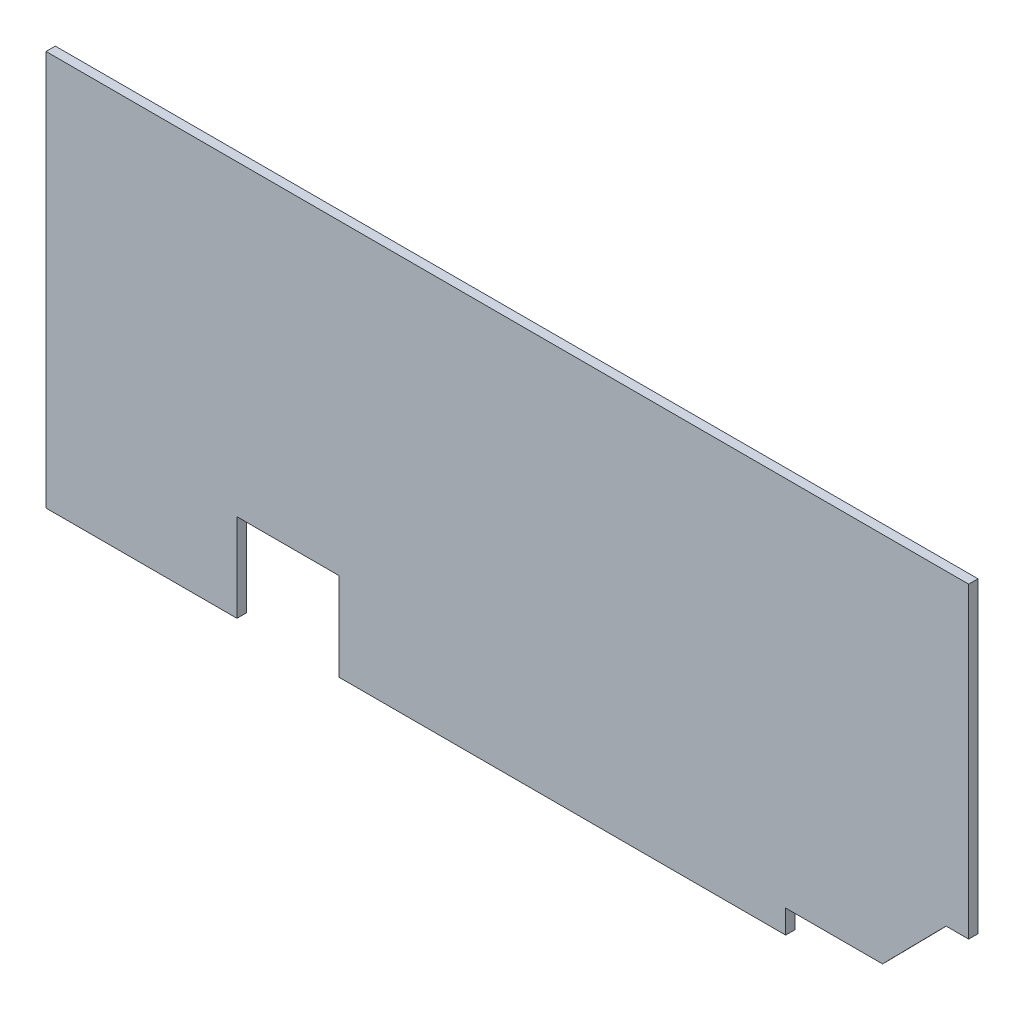
ISO-10303-21;
HEADER;
FILE_DESCRIPTION(('STEP AP214'),'2;1');
FILE_NAME('part.step','',(''),(''),'','','');
FILE_SCHEMA(('AUTOMOTIVE_DESIGN { 1 0 10303 214 1 1 1 1 }'));
ENDSEC;
DATA;
#1=APPLICATION_CONTEXT('core data for automotive mechanical design processes');
#2=APPLICATION_PROTOCOL_DEFINITION('international standard','automotive_design',2000,#1);
#3=PRODUCT_CONTEXT('',#1,'mechanical');
#4=PRODUCT('Part','Part','',(#3));
#5=PRODUCT_RELATED_PRODUCT_CATEGORY('part','',(#4));
#6=PRODUCT_DEFINITION_FORMATION('','',#4);
#7=PRODUCT_DEFINITION_CONTEXT('part definition',#1,'design');
#8=PRODUCT_DEFINITION('design','',#6,#7);
#9=PRODUCT_DEFINITION_SHAPE('','',#8);
#10=(LENGTH_UNIT() NAMED_UNIT(*) SI_UNIT(.MILLI.,.METRE.));
#11=(NAMED_UNIT(*) PLANE_ANGLE_UNIT() SI_UNIT($,.RADIAN.));
#12=(NAMED_UNIT(*) SI_UNIT($,.STERADIAN.) SOLID_ANGLE_UNIT());
#13=UNCERTAINTY_MEASURE_WITH_UNIT(LENGTH_MEASURE(1.E-05),#10,'distance_accuracy_value','');
#14=(GEOMETRIC_REPRESENTATION_CONTEXT(3) GLOBAL_UNCERTAINTY_ASSIGNED_CONTEXT((#13)) GLOBAL_UNIT_ASSIGNED_CONTEXT((#10,
#11,#12)) REPRESENTATION_CONTEXT('',''));
#15=CARTESIAN_POINT('',(0.,0.,0.));
#16=DIRECTION('',(0.,0.,1.));
#17=DIRECTION('',(1.,0.,0.));
#18=AXIS2_PLACEMENT_3D('',#15,#16,#17);
#19=CARTESIAN_POINT('',(-268.400790405261,107.434120248216,3.175));
#20=DIRECTION('',(1.,0.,0.));
#21=DIRECTION('',(0.,0.,-1.));
#22=AXIS2_PLACEMENT_3D('',#19,#20,#21);
#23=PLANE('',#22);
#24=DIRECTION('',(0.,-1.,0.));
#25=VECTOR('',#24,1.);
#26=CARTESIAN_POINT('',(-268.400790405261,107.434120248216,0.));
#27=LINE('',#26,#25);
#28=CARTESIAN_POINT('',(-268.400790405261,107.434120248216,0.));
#29=VERTEX_POINT('',#28);
#30=CARTESIAN_POINT('',(-268.400790405261,-27.3408797517839,0.));
#31=VERTEX_POINT('',#30);
#32=EDGE_CURVE('E159',#29,#31,#27,.T.);
#33=ORIENTED_EDGE('',*,*,#32,.T.);
#34=DIRECTION('',(0.,0.,-1.));
#35=VECTOR('',#34,1.);
#36=CARTESIAN_POINT('',(-268.400790405261,-27.3408797517839,3.175));
#37=LINE('',#36,#35);
#38=CARTESIAN_POINT('',(-268.400790405261,-27.3408797517839,3.175));
#39=VERTEX_POINT('',#38);
#40=EDGE_CURVE('E11',#39,#31,#37,.T.);
#41=ORIENTED_EDGE('',*,*,#40,.F.);
#42=DIRECTION('',(0.,-1.,0.));
#43=VECTOR('',#42,1.);
#44=CARTESIAN_POINT('',(-268.400790405261,107.434120248216,3.175));
#45=LINE('',#44,#43);
#46=CARTESIAN_POINT('',(-268.400790405261,107.434120248216,3.175));
#47=VERTEX_POINT('',#46);
#48=EDGE_CURVE('E181',#47,#39,#45,.T.);
#49=ORIENTED_EDGE('',*,*,#48,.F.);
#50=DIRECTION('',(0.,0.,-1.));
#51=VECTOR('',#50,1.);
#52=CARTESIAN_POINT('',(-268.400790405261,107.434120248216,3.175));
#53=LINE('',#52,#51);
#54=EDGE_CURVE('E155',#47,#29,#53,.T.);
#55=ORIENTED_EDGE('',*,*,#54,.T.);
#56=EDGE_LOOP('',(#33,#41,#49,#55));
#57=FACE_BOUND('',#56,.T.);
#58=ADVANCED_FACE('F39',(#57),#23,.F.);
#59=CARTESIAN_POINT('',(-268.400790405261,-27.3408797517839,3.175));
#60=DIRECTION('',(0.,1.,0.));
#61=DIRECTION('',(-1.,0.,0.));
#62=AXIS2_PLACEMENT_3D('',#59,#60,#61);
#63=PLANE('',#62);
#64=DIRECTION('',(1.,0.,0.));
#65=VECTOR('',#64,1.);
#66=CARTESIAN_POINT('',(-268.400790405261,-27.3408797517839,0.));
#67=LINE('',#66,#65);
#68=CARTESIAN_POINT('',(-203.320790345717,-27.3408797517839,0.));
#69=VERTEX_POINT('',#68);
#70=EDGE_CURVE('E162',#31,#69,#67,.T.);
#71=ORIENTED_EDGE('',*,*,#70,.T.);
#72=DIRECTION('',(0.,0.,-1.));
#73=VECTOR('',#72,1.);
#74=CARTESIAN_POINT('',(-203.320790345717,-27.3408797517839,3.175));
#75=LINE('',#74,#73);
#76=CARTESIAN_POINT('',(-203.320790345717,-27.3408797517839,3.175));
#77=VERTEX_POINT('',#76);
#78=EDGE_CURVE('E47',#77,#69,#75,.T.);
#79=ORIENTED_EDGE('',*,*,#78,.F.);
#80=DIRECTION('',(1.,0.,0.));
#81=VECTOR('',#80,1.);
#82=CARTESIAN_POINT('',(-268.400790405261,-27.3408797517839,3.175));
#83=LINE('',#82,#81);
#84=EDGE_CURVE('E110',#39,#77,#83,.T.);
#85=ORIENTED_EDGE('',*,*,#84,.F.);
#86=ORIENTED_EDGE('',*,*,#40,.T.);
#87=EDGE_LOOP('',(#71,#79,#85,#86));
#88=FACE_BOUND('',#87,.T.);
#89=ADVANCED_FACE('F259',(#88),#63,.F.);
#90=CARTESIAN_POINT('',(-203.320790345717,-27.3408797517839,3.175));
#91=DIRECTION('',(-1.,0.,0.));
#92=DIRECTION('',(0.,0.,1.));
#93=AXIS2_PLACEMENT_3D('',#90,#91,#92);
#94=PLANE('',#93);
#95=DIRECTION('',(0.,1.,0.));
#96=VECTOR('',#95,1.);
#97=CARTESIAN_POINT('',(-203.320790345717,-27.3408797517839,0.));
#98=LINE('',#97,#96);
#99=CARTESIAN_POINT('',(-203.320790345717,2.6591202482161,0.));
#100=VERTEX_POINT('',#99);
#101=EDGE_CURVE('E164',#69,#100,#98,.T.);
#102=ORIENTED_EDGE('',*,*,#101,.T.);
#103=DIRECTION('',(0.,0.,-1.));
#104=VECTOR('',#103,1.);
#105=CARTESIAN_POINT('',(-203.320790345717,2.6591202482161,3.175));
#106=LINE('',#105,#104);
#107=CARTESIAN_POINT('',(-203.320790345717,2.6591202482161,3.175));
#108=VERTEX_POINT('',#107);
#109=EDGE_CURVE('E200',#108,#100,#106,.T.);
#110=ORIENTED_EDGE('',*,*,#109,.F.);
#111=DIRECTION('',(0.,1.,0.));
#112=VECTOR('',#111,1.);
#113=CARTESIAN_POINT('',(-203.320790345717,-27.3408797517839,3.175));
#114=LINE('',#113,#112);
#115=EDGE_CURVE('E208',#77,#108,#114,.T.);
#116=ORIENTED_EDGE('',*,*,#115,.F.);
#117=ORIENTED_EDGE('',*,*,#78,.T.);
#118=EDGE_LOOP('',(#102,#110,#116,#117));
#119=FACE_BOUND('',#118,.T.);
#120=ADVANCED_FACE('F206',(#119),#94,.F.);
#121=CARTESIAN_POINT('',(-203.320790345717,2.6591202482161,3.175));
#122=DIRECTION('',(0.,1.,0.));
#123=DIRECTION('',(-1.,0.,0.));
#124=AXIS2_PLACEMENT_3D('',#121,#122,#123);
#125=PLANE('',#124);
#126=DIRECTION('',(1.,0.,0.));
#127=VECTOR('',#126,1.);
#128=CARTESIAN_POINT('',(-203.320790345717,2.6591202482161,0.));
#129=LINE('',#128,#127);
#130=CARTESIAN_POINT('',(-168.566368425902,2.65912024821626,0.));
#131=VERTEX_POINT('',#130);
#132=EDGE_CURVE('E166',#100,#131,#129,.T.);
#133=ORIENTED_EDGE('',*,*,#132,.T.);
#134=DIRECTION('',(0.,0.,-1.));
#135=VECTOR('',#134,1.);
#136=CARTESIAN_POINT('',(-168.566368425902,2.65912024821626,3.175));
#137=LINE('',#136,#135);
#138=CARTESIAN_POINT('',(-168.566368425902,2.65912024821626,3.175));
#139=VERTEX_POINT('',#138);
#140=EDGE_CURVE('E197',#139,#131,#137,.T.);
#141=ORIENTED_EDGE('',*,*,#140,.F.);
#142=DIRECTION('',(1.,0.,0.));
#143=VECTOR('',#142,1.);
#144=CARTESIAN_POINT('',(-203.320790345717,2.6591202482161,3.175));
#145=LINE('',#144,#143);
#146=EDGE_CURVE('E226',#108,#139,#145,.T.);
#147=ORIENTED_EDGE('',*,*,#146,.F.);
#148=ORIENTED_EDGE('',*,*,#109,.T.);
#149=EDGE_LOOP('',(#133,#141,#147,#148));
#150=FACE_BOUND('',#149,.T.);
#151=ADVANCED_FACE('F217',(#150),#125,.F.);
#152=CARTESIAN_POINT('',(-168.566368425902,2.65912024821626,3.175));
#153=DIRECTION('',(1.,0.,0.));
#154=DIRECTION('',(0.,0.,-1.));
#155=AXIS2_PLACEMENT_3D('',#152,#153,#154);
#156=PLANE('',#155);
#157=DIRECTION('',(0.,-1.,0.));
#158=VECTOR('',#157,1.);
#159=CARTESIAN_POINT('',(-168.566368425902,2.65912024821626,0.));
#160=LINE('',#159,#158);
#161=CARTESIAN_POINT('',(-168.566368425902,-27.3408797517837,0.));
#162=VERTEX_POINT('',#161);
#163=EDGE_CURVE('E168',#131,#162,#160,.T.);
#164=ORIENTED_EDGE('',*,*,#163,.T.);
#165=DIRECTION('',(0.,0.,-1.));
#166=VECTOR('',#165,1.);
#167=CARTESIAN_POINT('',(-168.566368425902,-27.3408797517837,3.175));
#168=LINE('',#167,#166);
#169=CARTESIAN_POINT('',(-168.566368425902,-27.3408797517837,3.175));
#170=VERTEX_POINT('',#169);
#171=EDGE_CURVE('E194',#170,#162,#168,.T.);
#172=ORIENTED_EDGE('',*,*,#171,.F.);
#173=DIRECTION('',(0.,-1.,0.));
#174=VECTOR('',#173,1.);
#175=CARTESIAN_POINT('',(-168.566368425902,2.65912024821626,3.175));
#176=LINE('',#175,#174);
#177=EDGE_CURVE('E223',#139,#170,#176,.T.);
#178=ORIENTED_EDGE('',*,*,#177,.F.);
#179=ORIENTED_EDGE('',*,*,#140,.T.);
#180=EDGE_LOOP('',(#164,#172,#178,#179));
#181=FACE_BOUND('',#180,.T.);
#182=ADVANCED_FACE('F221',(#181),#156,.F.);
#183=CARTESIAN_POINT('',(-168.566368425902,-27.3408797517837,3.175));
#184=DIRECTION('',(0.,1.,0.));
#185=DIRECTION('',(-1.,0.,0.));
#186=AXIS2_PLACEMENT_3D('',#183,#184,#185);
#187=PLANE('',#186);
#188=DIRECTION('',(1.,0.,0.));
#189=VECTOR('',#188,1.);
#190=CARTESIAN_POINT('',(-168.566368425902,-27.3408797517837,0.));
#191=LINE('',#190,#189);
#192=CARTESIAN_POINT('',(-16.3207904052615,-27.340879751784,0.));
#193=VERTEX_POINT('',#192);
#194=EDGE_CURVE('E170',#162,#193,#191,.T.);
#195=ORIENTED_EDGE('',*,*,#194,.T.);
#196=DIRECTION('',(0.,0.,-1.));
#197=VECTOR('',#196,1.);
#198=CARTESIAN_POINT('',(-16.3207904052615,-27.340879751784,3.175));
#199=LINE('',#198,#197);
#200=CARTESIAN_POINT('',(-16.3207904052615,-27.340879751784,3.175));
#201=VERTEX_POINT('',#200);
#202=EDGE_CURVE('E191',#201,#193,#199,.T.);
#203=ORIENTED_EDGE('',*,*,#202,.F.);
#204=DIRECTION('',(1.,0.,0.));
#205=VECTOR('',#204,1.);
#206=CARTESIAN_POINT('',(-168.566368425902,-27.3408797517837,3.175));
#207=LINE('',#206,#205);
#208=EDGE_CURVE('E225',#170,#201,#207,.T.);
#209=ORIENTED_EDGE('',*,*,#208,.F.);
#210=ORIENTED_EDGE('',*,*,#171,.T.);
#211=EDGE_LOOP('',(#195,#203,#209,#210));
#212=FACE_BOUND('',#211,.T.);
#213=ADVANCED_FACE('F272',(#212),#187,.F.);
#214=CARTESIAN_POINT('',(-16.3207904052615,-27.340879751784,3.175));
#215=DIRECTION('',(-1.,0.,0.));
#216=DIRECTION('',(0.,0.,1.));
#217=AXIS2_PLACEMENT_3D('',#214,#215,#216);
#218=PLANE('',#217);
#219=DIRECTION('',(0.,1.,0.));
#220=VECTOR('',#219,1.);
#221=CARTESIAN_POINT('',(-16.3207904052615,-27.340879751784,0.));
#222=LINE('',#221,#220);
#223=CARTESIAN_POINT('',(-16.3207904052615,-19.340879751784,0.));
#224=VERTEX_POINT('',#223);
#225=EDGE_CURVE('E172',#193,#224,#222,.T.);
#226=ORIENTED_EDGE('',*,*,#225,.T.);
#227=DIRECTION('',(0.,0.,-1.));
#228=VECTOR('',#227,1.);
#229=CARTESIAN_POINT('',(-16.3207904052615,-19.340879751784,3.175));
#230=LINE('',#229,#228);
#231=CARTESIAN_POINT('',(-16.3207904052615,-19.340879751784,3.175));
#232=VERTEX_POINT('',#231);
#233=EDGE_CURVE('E188',#232,#224,#230,.T.);
#234=ORIENTED_EDGE('',*,*,#233,.F.);
#235=DIRECTION('',(0.,1.,0.));
#236=VECTOR('',#235,1.);
#237=CARTESIAN_POINT('',(-16.3207904052615,-27.340879751784,3.175));
#238=LINE('',#237,#236);
#239=EDGE_CURVE('E228',#201,#232,#238,.T.);
#240=ORIENTED_EDGE('',*,*,#239,.F.);
#241=ORIENTED_EDGE('',*,*,#202,.T.);
#242=EDGE_LOOP('',(#226,#234,#240,#241));
#243=FACE_BOUND('',#242,.T.);
#244=ADVANCED_FACE('F275',(#243),#218,.F.);
#245=CARTESIAN_POINT('',(-16.3207904052615,-19.340879751784,3.175));
#246=DIRECTION('',(0.,1.,0.));
#247=DIRECTION('',(0.,0.,1.));
#248=AXIS2_PLACEMENT_3D('',#245,#246,#247);
#249=PLANE('',#248);
#250=DIRECTION('',(1.,0.,0.));
#251=VECTOR('',#250,1.);
#252=CARTESIAN_POINT('',(-16.3207904052615,-19.340879751784,0.));
#253=LINE('',#252,#251);
#254=CARTESIAN_POINT('',(16.6792095947385,-19.340879751784,0.));
#255=VERTEX_POINT('',#254);
#256=EDGE_CURVE('E174',#224,#255,#253,.T.);
#257=ORIENTED_EDGE('',*,*,#256,.T.);
#258=DIRECTION('',(0.,0.,-1.));
#259=VECTOR('',#258,1.);
#260=CARTESIAN_POINT('',(16.6792095947385,-19.340879751784,3.175));
#261=LINE('',#260,#259);
#262=CARTESIAN_POINT('',(16.6792095947385,-19.340879751784,3.175));
#263=VERTEX_POINT('',#262);
#264=EDGE_CURVE('E185',#263,#255,#261,.T.);
#265=ORIENTED_EDGE('',*,*,#264,.F.);
#266=DIRECTION('',(1.,0.,0.));
#267=VECTOR('',#266,1.);
#268=CARTESIAN_POINT('',(-16.3207904052615,-19.340879751784,3.175));
#269=LINE('',#268,#267);
#270=EDGE_CURVE('E234',#232,#263,#269,.T.);
#271=ORIENTED_EDGE('',*,*,#270,.F.);
#272=ORIENTED_EDGE('',*,*,#233,.T.);
#273=EDGE_LOOP('',(#257,#265,#271,#272));
#274=FACE_BOUND('',#273,.T.);
#275=ADVANCED_FACE('F240',(#274),#249,.F.);
#276=CARTESIAN_POINT('',(16.6792095947385,-19.340879751784,3.175));
#277=DIRECTION('',(-0.712552157686594,0.701619143535992,0.));
#278=DIRECTION('',(-0.701619143535992,-0.712552157686594,0.));
#279=AXIS2_PLACEMENT_3D('',#276,#277,#278);
#280=PLANE('',#279);
#281=DIRECTION('',(0.701619143535992,0.712552157686594,0.));
#282=VECTOR('',#281,1.);
#283=CARTESIAN_POINT('',(16.6792095947385,-19.340879751784,0.));
#284=LINE('',#283,#282);
#285=CARTESIAN_POINT('',(38.3416535173081,2.65912024821603,0.));
#286=VERTEX_POINT('',#285);
#287=EDGE_CURVE('E176',#255,#286,#284,.T.);
#288=ORIENTED_EDGE('',*,*,#287,.T.);
#289=DIRECTION('',(0.,0.,-1.));
#290=VECTOR('',#289,1.);
#291=CARTESIAN_POINT('',(38.3416535173081,2.65912024821603,3.175));
#292=LINE('',#291,#290);
#293=CARTESIAN_POINT('',(38.3416535173081,2.65912024821603,3.175));
#294=VERTEX_POINT('',#293);
#295=EDGE_CURVE('E150',#294,#286,#292,.T.);
#296=ORIENTED_EDGE('',*,*,#295,.F.);
#297=DIRECTION('',(0.701619143535992,0.712552157686594,0.));
#298=VECTOR('',#297,1.);
#299=CARTESIAN_POINT('',(16.6792095947385,-19.340879751784,3.175));
#300=LINE('',#299,#298);
#301=EDGE_CURVE('E141',#263,#294,#300,.T.);
#302=ORIENTED_EDGE('',*,*,#301,.F.);
#303=ORIENTED_EDGE('',*,*,#264,.T.);
#304=EDGE_LOOP('',(#288,#296,#302,#303));
#305=FACE_BOUND('',#304,.T.);
#306=ADVANCED_FACE('F244',(#305),#280,.F.);
#307=CARTESIAN_POINT('',(38.3416535173081,2.65912024821603,3.175));
#308=DIRECTION('',(0.,1.,0.));
#309=DIRECTION('',(-1.,0.,0.));
#310=AXIS2_PLACEMENT_3D('',#307,#308,#309);
#311=PLANE('',#310);
#312=DIRECTION('',(1.,0.,0.));
#313=VECTOR('',#312,1.);
#314=CARTESIAN_POINT('',(38.3416535173081,2.65912024821603,0.));
#315=LINE('',#314,#313);
#316=CARTESIAN_POINT('',(46.0496224956299,2.65912024821603,0.));
#317=VERTEX_POINT('',#316);
#318=EDGE_CURVE('E149',#286,#317,#315,.T.);
#319=ORIENTED_EDGE('',*,*,#318,.T.);
#320=DIRECTION('',(0.,0.,-1.));
#321=VECTOR('',#320,1.);
#322=CARTESIAN_POINT('',(46.0496224956299,2.65912024821603,3.175));
#323=LINE('',#322,#321);
#324=CARTESIAN_POINT('',(46.0496224956299,2.65912024821603,3.175));
#325=VERTEX_POINT('',#324);
#326=EDGE_CURVE('E146',#325,#317,#323,.T.);
#327=ORIENTED_EDGE('',*,*,#326,.F.);
#328=DIRECTION('',(1.,0.,0.));
#329=VECTOR('',#328,1.);
#330=CARTESIAN_POINT('',(38.3416535173081,2.65912024821603,3.175));
#331=LINE('',#330,#329);
#332=EDGE_CURVE('E135',#294,#325,#331,.T.);
#333=ORIENTED_EDGE('',*,*,#332,.F.);
#334=ORIENTED_EDGE('',*,*,#295,.T.);
#335=EDGE_LOOP('',(#319,#327,#333,#334));
#336=FACE_BOUND('',#335,.T.);
#337=ADVANCED_FACE('F147',(#336),#311,.F.);
#338=CARTESIAN_POINT('',(46.0496224956299,2.65912024821603,3.175));
#339=DIRECTION('',(-1.,0.,0.));
#340=DIRECTION('',(0.,0.,1.));
#341=AXIS2_PLACEMENT_3D('',#338,#339,#340);
#342=PLANE('',#341);
#343=DIRECTION('',(0.,1.,0.));
#344=VECTOR('',#343,1.);
#345=CARTESIAN_POINT('',(46.0496224956299,2.65912024821603,0.));
#346=LINE('',#345,#344);
#347=CARTESIAN_POINT('',(46.0496224956299,107.434120248216,0.));
#348=VERTEX_POINT('',#347);
#349=EDGE_CURVE('E96',#317,#348,#346,.T.);
#350=ORIENTED_EDGE('',*,*,#349,.T.);
#351=DIRECTION('',(0.,0.,-1.));
#352=VECTOR('',#351,1.);
#353=CARTESIAN_POINT('',(46.0496224956299,107.434120248216,3.175));
#354=LINE('',#353,#352);
#355=CARTESIAN_POINT('',(46.0496224956299,107.434120248216,3.175));
#356=VERTEX_POINT('',#355);
#357=EDGE_CURVE('E151',#356,#348,#354,.T.);
#358=ORIENTED_EDGE('',*,*,#357,.F.);
#359=DIRECTION('',(0.,1.,0.));
#360=VECTOR('',#359,1.);
#361=CARTESIAN_POINT('',(46.0496224956299,2.65912024821603,3.175));
#362=LINE('',#361,#360);
#363=EDGE_CURVE('E139',#325,#356,#362,.T.);
#364=ORIENTED_EDGE('',*,*,#363,.F.);
#365=ORIENTED_EDGE('',*,*,#326,.T.);
#366=EDGE_LOOP('',(#350,#358,#364,#365));
#367=FACE_BOUND('',#366,.T.);
#368=ADVANCED_FACE('F153',(#367),#342,.F.);
#369=CARTESIAN_POINT('',(-268.400790405261,107.434120248216,3.175));
#370=DIRECTION('',(0.,-1.,0.));
#371=DIRECTION('',(0.,0.,-1.));
#372=AXIS2_PLACEMENT_3D('',#369,#370,#371);
#373=PLANE('',#372);
#374=DIRECTION('',(-1.,0.,0.));
#375=VECTOR('',#374,1.);
#376=CARTESIAN_POINT('',(-268.400790405261,107.434120248216,0.));
#377=LINE('',#376,#375);
#378=EDGE_CURVE('E102',#348,#29,#377,.T.);
#379=ORIENTED_EDGE('',*,*,#378,.T.);
#380=ORIENTED_EDGE('',*,*,#54,.F.);
#381=DIRECTION('',(-1.,0.,0.));
#382=VECTOR('',#381,1.);
#383=CARTESIAN_POINT('',(-268.400790405261,107.434120248216,3.175));
#384=LINE('',#383,#382);
#385=EDGE_CURVE('E55',#356,#47,#384,.T.);
#386=ORIENTED_EDGE('',*,*,#385,.F.);
#387=ORIENTED_EDGE('',*,*,#357,.T.);
#388=EDGE_LOOP('',(#379,#380,#386,#387));
#389=FACE_BOUND('',#388,.T.);
#390=ADVANCED_FACE('F248',(#389),#373,.F.);
#391=CARTESIAN_POINT('',(0.,0.,3.175));
#392=DIRECTION('',(0.,0.,1.));
#393=DIRECTION('',(1.,0.,0.));
#394=AXIS2_PLACEMENT_3D('',#391,#392,#393);
#395=PLANE('',#394);
#396=ORIENTED_EDGE('',*,*,#48,.T.);
#397=ORIENTED_EDGE('',*,*,#84,.T.);
#398=ORIENTED_EDGE('',*,*,#115,.T.);
#399=ORIENTED_EDGE('',*,*,#146,.T.);
#400=ORIENTED_EDGE('',*,*,#177,.T.);
#401=ORIENTED_EDGE('',*,*,#208,.T.);
#402=ORIENTED_EDGE('',*,*,#239,.T.);
#403=ORIENTED_EDGE('',*,*,#270,.T.);
#404=ORIENTED_EDGE('',*,*,#301,.T.);
#405=ORIENTED_EDGE('',*,*,#332,.T.);
#406=ORIENTED_EDGE('',*,*,#363,.T.);
#407=ORIENTED_EDGE('',*,*,#385,.T.);
#408=EDGE_LOOP('',(#396,#397,#398,#399,#400,#401,#402,#403,#404,#405,#406,#407));
#409=FACE_BOUND('',#408,.T.);
#410=ADVANCED_FACE('F137',(#409),#395,.T.);
#411=CARTESIAN_POINT('',(0.,0.,0.));
#412=DIRECTION('',(0.,0.,1.));
#413=DIRECTION('',(1.,0.,0.));
#414=AXIS2_PLACEMENT_3D('',#411,#412,#413);
#415=PLANE('',#414);
#416=ORIENTED_EDGE('',*,*,#32,.F.);
#417=ORIENTED_EDGE('',*,*,#378,.F.);
#418=ORIENTED_EDGE('',*,*,#349,.F.);
#419=ORIENTED_EDGE('',*,*,#318,.F.);
#420=ORIENTED_EDGE('',*,*,#287,.F.);
#421=ORIENTED_EDGE('',*,*,#256,.F.);
#422=ORIENTED_EDGE('',*,*,#225,.F.);
#423=ORIENTED_EDGE('',*,*,#194,.F.);
#424=ORIENTED_EDGE('',*,*,#163,.F.);
#425=ORIENTED_EDGE('',*,*,#132,.F.);
#426=ORIENTED_EDGE('',*,*,#101,.F.);
#427=ORIENTED_EDGE('',*,*,#70,.F.);
#428=EDGE_LOOP('',(#416,#417,#418,#419,#420,#421,#422,#423,#424,#425,#426,#427));
#429=FACE_BOUND('',#428,.T.);
#430=ADVANCED_FACE('F212',(#429),#415,.F.);
#431=CLOSED_SHELL('',(#58,#89,#120,#151,#182,#213,#244,#275,#306,#337,#368,#390,#410,#430));
#432=MANIFOLD_SOLID_BREP('B2',#431);
#433=ADVANCED_BREP_SHAPE_REPRESENTATION('',(#18,#432),#14);
#434=SHAPE_DEFINITION_REPRESENTATION(#9,#433);
ENDSEC;
END-ISO-10303-21;
